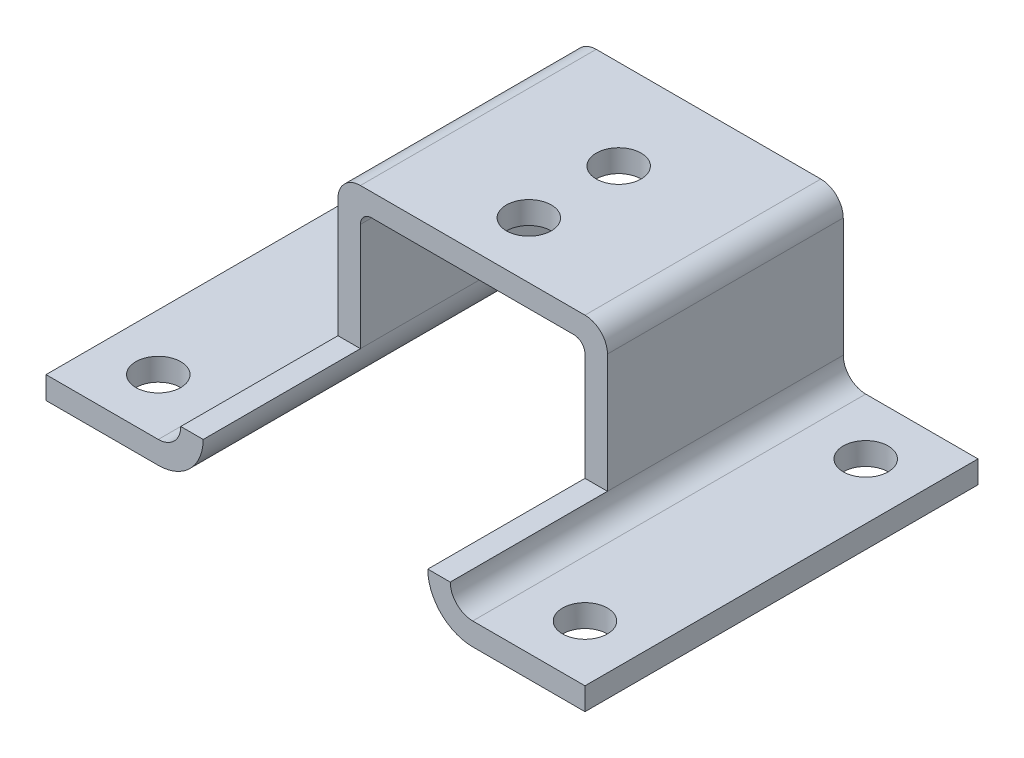
ISO-10303-21;
HEADER;
FILE_DESCRIPTION(('STEP AP214'),'2;1');
FILE_NAME('part.step','',(''),(''),'','','');
FILE_SCHEMA(('AUTOMOTIVE_DESIGN { 1 0 10303 214 1 1 1 1 }'));
ENDSEC;
DATA;
#1=APPLICATION_CONTEXT('core data for automotive mechanical design processes');
#2=APPLICATION_PROTOCOL_DEFINITION('international standard','automotive_design',2000,#1);
#3=PRODUCT_CONTEXT('',#1,'mechanical');
#4=PRODUCT('Part','Part','',(#3));
#5=PRODUCT_RELATED_PRODUCT_CATEGORY('part','',(#4));
#6=PRODUCT_DEFINITION_FORMATION('','',#4);
#7=PRODUCT_DEFINITION_CONTEXT('part definition',#1,'design');
#8=PRODUCT_DEFINITION('design','',#6,#7);
#9=PRODUCT_DEFINITION_SHAPE('','',#8);
#10=(LENGTH_UNIT() NAMED_UNIT(*) SI_UNIT(.MILLI.,.METRE.));
#11=(NAMED_UNIT(*) PLANE_ANGLE_UNIT() SI_UNIT($,.RADIAN.));
#12=(NAMED_UNIT(*) SI_UNIT($,.STERADIAN.) SOLID_ANGLE_UNIT());
#13=UNCERTAINTY_MEASURE_WITH_UNIT(LENGTH_MEASURE(1.E-05),#10,'distance_accuracy_value','');
#14=(GEOMETRIC_REPRESENTATION_CONTEXT(3) GLOBAL_UNCERTAINTY_ASSIGNED_CONTEXT((#13)) GLOBAL_UNIT_ASSIGNED_CONTEXT((#10,
#11,#12)) REPRESENTATION_CONTEXT('',''));
#15=CARTESIAN_POINT('',(0.,0.,0.));
#16=DIRECTION('',(0.,0.,1.));
#17=DIRECTION('',(1.,0.,0.));
#18=AXIS2_PLACEMENT_3D('',#15,#16,#17);
#19=CARTESIAN_POINT('',(0.,18.2678720989585,35.));
#20=DIRECTION('',(0.,-1.,0.));
#21=DIRECTION('',(0.,0.,-1.));
#22=AXIS2_PLACEMENT_3D('',#19,#20,#21);
#23=PLANE('',#22);
#24=CARTESIAN_POINT('',(19.,18.2678720989585,30.));
#25=DIRECTION('',(0.,-1.,0.));
#26=DIRECTION('',(0.,0.,-1.));
#27=AXIS2_PLACEMENT_3D('',#24,#25,#26);
#28=CIRCLE('',#27,2.);
#29=CARTESIAN_POINT('',(19.,18.2678720989585,28.));
#30=VERTEX_POINT('',#29);
#31=EDGE_CURVE('E354',#30,#30,#28,.T.);
#32=ORIENTED_EDGE('',*,*,#31,.T.);
#33=EDGE_LOOP('',(#32));
#34=FACE_BOUND('',#33,.T.);
#35=CARTESIAN_POINT('',(19.,18.2678720989585,5.));
#36=DIRECTION('',(0.,-1.,0.));
#37=DIRECTION('',(0.,0.,-1.));
#38=AXIS2_PLACEMENT_3D('',#35,#36,#37);
#39=CIRCLE('',#38,2.);
#40=CARTESIAN_POINT('',(19.,18.2678720989585,3.));
#41=VERTEX_POINT('',#40);
#42=EDGE_CURVE('E350',#41,#41,#39,.T.);
#43=ORIENTED_EDGE('',*,*,#42,.T.);
#44=EDGE_LOOP('',(#43));
#45=FACE_BOUND('',#44,.T.);
#46=DIRECTION('',(-1.,0.,0.));
#47=VECTOR('',#46,1.);
#48=CARTESIAN_POINT('',(0.,18.2678720989585,0.));
#49=LINE('',#48,#47);
#50=CARTESIAN_POINT('',(24.,18.2678720989585,0.));
#51=VERTEX_POINT('',#50);
#52=CARTESIAN_POINT('',(14.,18.2678720989585,0.));
#53=VERTEX_POINT('',#52);
#54=EDGE_CURVE('E302',#51,#53,#49,.T.);
#55=ORIENTED_EDGE('',*,*,#54,.T.);
#56=DIRECTION('',(0.,0.,-1.));
#57=VECTOR('',#56,1.);
#58=CARTESIAN_POINT('',(14.,18.2678720989585,35.));
#59=LINE('',#58,#57);
#60=CARTESIAN_POINT('',(14.,18.2678720989585,35.));
#61=VERTEX_POINT('',#60);
#62=EDGE_CURVE('E11',#61,#53,#59,.T.);
#63=ORIENTED_EDGE('',*,*,#62,.F.);
#64=DIRECTION('',(-1.,0.,0.));
#65=VECTOR('',#64,1.);
#66=CARTESIAN_POINT('',(0.,18.2678720989585,35.));
#67=LINE('',#66,#65);
#68=CARTESIAN_POINT('',(24.,18.2678720989585,35.));
#69=VERTEX_POINT('',#68);
#70=EDGE_CURVE('E303',#69,#61,#67,.T.);
#71=ORIENTED_EDGE('',*,*,#70,.F.);
#72=DIRECTION('',(0.,0.,-1.));
#73=VECTOR('',#72,1.);
#74=CARTESIAN_POINT('',(24.,18.2678720989585,35.));
#75=LINE('',#74,#73);
#76=EDGE_CURVE('E319',#69,#51,#75,.T.);
#77=ORIENTED_EDGE('',*,*,#76,.T.);
#78=EDGE_LOOP('',(#55,#63,#71,#77));
#79=FACE_BOUND('',#78,.T.);
#80=ADVANCED_FACE('F35',(#34,#45,#79),#23,.F.);
#81=CARTESIAN_POINT('',(14.,20.2678720989585,35.));
#82=DIRECTION('',(0.,0.,-1.));
#83=DIRECTION('',(-1.,0.,0.));
#84=AXIS2_PLACEMENT_3D('',#81,#82,#83);
#85=CYLINDRICAL_SURFACE('',#84,2.);
#86=CARTESIAN_POINT('',(14.,20.2678720989585,0.));
#87=DIRECTION('',(0.,0.,1.));
#88=DIRECTION('',(1.,0.,0.));
#89=AXIS2_PLACEMENT_3D('',#86,#87,#88);
#90=CIRCLE('',#89,2.);
#91=CARTESIAN_POINT('',(12.,20.2678720989585,0.));
#92=VERTEX_POINT('',#91);
#93=EDGE_CURVE('E322',#53,#92,#90,.F.);
#94=ORIENTED_EDGE('',*,*,#93,.T.);
#95=DIRECTION('',(0.,0.,-1.));
#96=VECTOR('',#95,1.);
#97=CARTESIAN_POINT('',(12.,20.2678720989585,21.));
#98=LINE('',#97,#96);
#99=CARTESIAN_POINT('',(12.,20.2678720989585,21.));
#100=VERTEX_POINT('',#99);
#101=EDGE_CURVE('E51',#100,#92,#98,.T.);
#102=ORIENTED_EDGE('',*,*,#101,.F.);
#103=DIRECTION('',(0.,0.,-1.));
#104=VECTOR('',#103,1.);
#105=CARTESIAN_POINT('',(12.,20.2678720989585,35.));
#106=LINE('',#105,#104);
#107=CARTESIAN_POINT('',(12.,20.2678720989585,35.));
#108=VERTEX_POINT('',#107);
#109=EDGE_CURVE('E43',#108,#100,#106,.T.);
#110=ORIENTED_EDGE('',*,*,#109,.F.);
#111=CARTESIAN_POINT('',(14.,20.2678720989585,35.));
#112=DIRECTION('',(0.,0.,1.));
#113=DIRECTION('',(1.,0.,0.));
#114=AXIS2_PLACEMENT_3D('',#111,#112,#113);
#115=CIRCLE('',#114,2.);
#116=EDGE_CURVE('E306',#61,#108,#115,.F.);
#117=ORIENTED_EDGE('',*,*,#116,.F.);
#118=ORIENTED_EDGE('',*,*,#62,.T.);
#119=EDGE_LOOP('',(#94,#102,#110,#117,#118));
#120=FACE_BOUND('',#119,.T.);
#121=ADVANCED_FACE('F451',(#120),#85,.F.);
#122=CARTESIAN_POINT('',(0.,20.2678720989584,35.));
#123=DIRECTION('',(0.,-1.,0.));
#124=DIRECTION('',(1.,0.,0.));
#125=AXIS2_PLACEMENT_3D('',#122,#123,#124);
#126=PLANE('',#125);
#127=ORIENTED_EDGE('',*,*,#109,.T.);
#128=DIRECTION('',(-1.,0.,0.));
#129=VECTOR('',#128,1.);
#130=CARTESIAN_POINT('',(0.,20.2678720989584,21.));
#131=LINE('',#130,#129);
#132=CARTESIAN_POINT('',(10.,20.2678720989585,21.));
#133=VERTEX_POINT('',#132);
#134=EDGE_CURVE('E58',#100,#133,#131,.T.);
#135=ORIENTED_EDGE('',*,*,#134,.T.);
#136=DIRECTION('',(0.,0.,-1.));
#137=VECTOR('',#136,1.);
#138=CARTESIAN_POINT('',(10.,20.2678720989585,35.));
#139=LINE('',#138,#137);
#140=CARTESIAN_POINT('',(10.,20.2678720989585,35.));
#141=VERTEX_POINT('',#140);
#142=EDGE_CURVE('E336',#141,#133,#139,.T.);
#143=ORIENTED_EDGE('',*,*,#142,.F.);
#144=DIRECTION('',(-1.,0.,0.));
#145=VECTOR('',#144,1.);
#146=CARTESIAN_POINT('',(0.,20.2678720989584,35.));
#147=LINE('',#146,#145);
#148=EDGE_CURVE('E309',#108,#141,#147,.T.);
#149=ORIENTED_EDGE('',*,*,#148,.F.);
#150=EDGE_LOOP('',(#127,#135,#143,#149));
#151=FACE_BOUND('',#150,.T.);
#152=ADVANCED_FACE('F444',(#151),#126,.F.);
#153=CARTESIAN_POINT('',(14.,20.2678720989585,35.));
#154=DIRECTION('',(0.,0.,-1.));
#155=DIRECTION('',(-1.,0.,0.));
#156=AXIS2_PLACEMENT_3D('',#153,#154,#155);
#157=CYLINDRICAL_SURFACE('',#156,4.);
#158=CARTESIAN_POINT('',(14.,20.2678720989585,0.));
#159=DIRECTION('',(0.,0.,1.));
#160=DIRECTION('',(1.,0.,0.));
#161=AXIS2_PLACEMENT_3D('',#158,#159,#160);
#162=CIRCLE('',#161,4.);
#163=CARTESIAN_POINT('',(14.,16.2678720989585,0.));
#164=VERTEX_POINT('',#163);
#165=CARTESIAN_POINT('',(10.,20.2678720989585,0.));
#166=VERTEX_POINT('',#165);
#167=EDGE_CURVE('E324',#164,#166,#162,.F.);
#168=ORIENTED_EDGE('',*,*,#167,.F.);
#169=DIRECTION('',(0.,0.,-1.));
#170=VECTOR('',#169,1.);
#171=CARTESIAN_POINT('',(14.,16.2678720989585,35.));
#172=LINE('',#171,#170);
#173=CARTESIAN_POINT('',(14.,16.2678720989585,35.));
#174=VERTEX_POINT('',#173);
#175=EDGE_CURVE('E334',#174,#164,#172,.T.);
#176=ORIENTED_EDGE('',*,*,#175,.F.);
#177=CARTESIAN_POINT('',(14.,20.2678720989585,35.));
#178=DIRECTION('',(0.,0.,1.));
#179=DIRECTION('',(1.,0.,0.));
#180=AXIS2_PLACEMENT_3D('',#177,#178,#179);
#181=CIRCLE('',#180,4.);
#182=EDGE_CURVE('E311',#174,#141,#181,.F.);
#183=ORIENTED_EDGE('',*,*,#182,.T.);
#184=ORIENTED_EDGE('',*,*,#142,.T.);
#185=DIRECTION('',(0.,0.,-1.));
#186=VECTOR('',#185,1.);
#187=CARTESIAN_POINT('',(10.,20.2678720989585,21.));
#188=LINE('',#187,#186);
#189=EDGE_CURVE('E280',#133,#166,#188,.T.);
#190=ORIENTED_EDGE('',*,*,#189,.T.);
#191=EDGE_LOOP('',(#168,#176,#183,#184,#190));
#192=FACE_BOUND('',#191,.T.);
#193=ADVANCED_FACE('F441',(#192),#157,.T.);
#194=CARTESIAN_POINT('',(0.,16.2678720989585,35.));
#195=DIRECTION('',(0.,-1.,0.));
#196=DIRECTION('',(1.,0.,0.));
#197=AXIS2_PLACEMENT_3D('',#194,#195,#196);
#198=PLANE('',#197);
#199=CARTESIAN_POINT('',(19.,16.2678720989585,30.));
#200=DIRECTION('',(0.,1.,0.));
#201=DIRECTION('',(0.,0.,1.));
#202=AXIS2_PLACEMENT_3D('',#199,#200,#201);
#203=CIRCLE('',#202,2.);
#204=CARTESIAN_POINT('',(19.,16.2678720989585,32.));
#205=VERTEX_POINT('',#204);
#206=EDGE_CURVE('E549',#205,#205,#203,.T.);
#207=ORIENTED_EDGE('',*,*,#206,.T.);
#208=EDGE_LOOP('',(#207));
#209=FACE_BOUND('',#208,.T.);
#210=CARTESIAN_POINT('',(19.,16.2678720989585,5.));
#211=DIRECTION('',(0.,1.,0.));
#212=DIRECTION('',(0.,0.,1.));
#213=AXIS2_PLACEMENT_3D('',#210,#211,#212);
#214=CIRCLE('',#213,2.);
#215=CARTESIAN_POINT('',(19.,16.2678720989585,7.));
#216=VERTEX_POINT('',#215);
#217=EDGE_CURVE('E547',#216,#216,#214,.T.);
#218=ORIENTED_EDGE('',*,*,#217,.T.);
#219=EDGE_LOOP('',(#218));
#220=FACE_BOUND('',#219,.T.);
#221=DIRECTION('',(-1.,0.,0.));
#222=VECTOR('',#221,1.);
#223=CARTESIAN_POINT('',(0.,16.2678720989585,0.));
#224=LINE('',#223,#222);
#225=CARTESIAN_POINT('',(24.,16.2678720989585,0.));
#226=VERTEX_POINT('',#225);
#227=EDGE_CURVE('E326',#226,#164,#224,.T.);
#228=ORIENTED_EDGE('',*,*,#227,.F.);
#229=DIRECTION('',(0.,0.,-1.));
#230=VECTOR('',#229,1.);
#231=CARTESIAN_POINT('',(24.,16.2678720989585,35.));
#232=LINE('',#231,#230);
#233=CARTESIAN_POINT('',(24.,16.2678720989585,35.));
#234=VERTEX_POINT('',#233);
#235=EDGE_CURVE('E332',#234,#226,#232,.T.);
#236=ORIENTED_EDGE('',*,*,#235,.F.);
#237=DIRECTION('',(-1.,0.,0.));
#238=VECTOR('',#237,1.);
#239=CARTESIAN_POINT('',(0.,16.2678720989585,35.));
#240=LINE('',#239,#238);
#241=EDGE_CURVE('E314',#234,#174,#240,.T.);
#242=ORIENTED_EDGE('',*,*,#241,.T.);
#243=ORIENTED_EDGE('',*,*,#175,.T.);
#244=EDGE_LOOP('',(#228,#236,#242,#243));
#245=FACE_BOUND('',#244,.T.);
#246=ADVANCED_FACE('F462',(#209,#220,#245),#198,.T.);
#247=CARTESIAN_POINT('',(24.,0.,35.));
#248=DIRECTION('',(-1.,0.,0.));
#249=DIRECTION('',(0.,0.,1.));
#250=AXIS2_PLACEMENT_3D('',#247,#248,#249);
#251=PLANE('',#250);
#252=DIRECTION('',(0.,1.,0.));
#253=VECTOR('',#252,1.);
#254=CARTESIAN_POINT('',(24.,0.,0.));
#255=LINE('',#254,#253);
#256=EDGE_CURVE('E307',#226,#51,#255,.T.);
#257=ORIENTED_EDGE('',*,*,#256,.T.);
#258=ORIENTED_EDGE('',*,*,#76,.F.);
#259=DIRECTION('',(0.,1.,0.));
#260=VECTOR('',#259,1.);
#261=CARTESIAN_POINT('',(24.,0.,35.));
#262=LINE('',#261,#260);
#263=EDGE_CURVE('E317',#234,#69,#262,.T.);
#264=ORIENTED_EDGE('',*,*,#263,.F.);
#265=ORIENTED_EDGE('',*,*,#235,.T.);
#266=EDGE_LOOP('',(#257,#258,#264,#265));
#267=FACE_BOUND('',#266,.T.);
#268=ADVANCED_FACE('F465',(#267),#251,.F.);
#269=CARTESIAN_POINT('',(0.,0.,35.));
#270=DIRECTION('',(0.,0.,1.));
#271=DIRECTION('',(1.,0.,0.));
#272=AXIS2_PLACEMENT_3D('',#269,#270,#271);
#273=PLANE('',#272);
#274=ORIENTED_EDGE('',*,*,#70,.T.);
#275=ORIENTED_EDGE('',*,*,#116,.T.);
#276=ORIENTED_EDGE('',*,*,#148,.T.);
#277=ORIENTED_EDGE('',*,*,#182,.F.);
#278=ORIENTED_EDGE('',*,*,#241,.F.);
#279=ORIENTED_EDGE('',*,*,#263,.T.);
#280=EDGE_LOOP('',(#274,#275,#276,#277,#278,#279));
#281=FACE_BOUND('',#280,.T.);
#282=ADVANCED_FACE('F447',(#281),#273,.T.);
#283=CARTESIAN_POINT('',(0.,0.,0.));
#284=DIRECTION('',(0.,0.,1.));
#285=DIRECTION('',(1.,0.,0.));
#286=AXIS2_PLACEMENT_3D('',#283,#284,#285);
#287=PLANE('',#286);
#288=ORIENTED_EDGE('',*,*,#54,.F.);
#289=ORIENTED_EDGE('',*,*,#256,.F.);
#290=ORIENTED_EDGE('',*,*,#227,.T.);
#291=ORIENTED_EDGE('',*,*,#167,.T.);
#292=DIRECTION('',(0.,1.,0.));
#293=VECTOR('',#292,1.);
#294=CARTESIAN_POINT('',(10.,0.,0.));
#295=LINE('',#294,#293);
#296=CARTESIAN_POINT('',(10.,29.8536585365853,0.));
#297=VERTEX_POINT('',#296);
#298=EDGE_CURVE('E268',#166,#297,#295,.T.);
#299=ORIENTED_EDGE('',*,*,#298,.T.);
#300=CARTESIAN_POINT('',(9.,29.8536585365853,0.));
#301=DIRECTION('',(0.,0.,1.));
#302=DIRECTION('',(1.,0.,0.));
#303=AXIS2_PLACEMENT_3D('',#300,#301,#302);
#304=CIRCLE('',#303,1.);
#305=CARTESIAN_POINT('',(8.99999999999999,30.8536585365853,0.));
#306=VERTEX_POINT('',#305);
#307=EDGE_CURVE('E265',#297,#306,#304,.T.);
#308=ORIENTED_EDGE('',*,*,#307,.T.);
#309=DIRECTION('',(1.,0.,0.));
#310=VECTOR('',#309,1.);
#311=CARTESIAN_POINT('',(0.,30.8536585365853,0.));
#312=LINE('',#311,#310);
#313=CARTESIAN_POINT('',(-8.99999999999999,30.8536585365853,0.));
#314=VERTEX_POINT('',#313);
#315=EDGE_CURVE('E262',#314,#306,#312,.T.);
#316=ORIENTED_EDGE('',*,*,#315,.F.);
#317=CARTESIAN_POINT('',(-9.,29.8536585365853,0.));
#318=DIRECTION('',(0.,0.,1.));
#319=DIRECTION('',(1.,0.,0.));
#320=AXIS2_PLACEMENT_3D('',#317,#318,#319);
#321=CIRCLE('',#320,1.);
#322=CARTESIAN_POINT('',(-10.,29.8536585365853,0.));
#323=VERTEX_POINT('',#322);
#324=EDGE_CURVE('E260',#323,#314,#321,.F.);
#325=ORIENTED_EDGE('',*,*,#324,.F.);
#326=DIRECTION('',(0.,1.,0.));
#327=VECTOR('',#326,1.);
#328=CARTESIAN_POINT('',(-10.,0.,0.));
#329=LINE('',#328,#327);
#330=CARTESIAN_POINT('',(-10.,20.2678720989585,0.));
#331=VERTEX_POINT('',#330);
#332=EDGE_CURVE('E258',#331,#323,#329,.T.);
#333=ORIENTED_EDGE('',*,*,#332,.F.);
#334=CARTESIAN_POINT('',(-14.,20.2678720989585,0.));
#335=DIRECTION('',(0.,0.,1.));
#336=DIRECTION('',(1.,0.,0.));
#337=AXIS2_PLACEMENT_3D('',#334,#335,#336);
#338=CIRCLE('',#337,4.);
#339=CARTESIAN_POINT('',(-14.,16.2678720989585,0.));
#340=VERTEX_POINT('',#339);
#341=EDGE_CURVE('E373',#340,#331,#338,.T.);
#342=ORIENTED_EDGE('',*,*,#341,.F.);
#343=DIRECTION('',(1.,0.,0.));
#344=VECTOR('',#343,1.);
#345=CARTESIAN_POINT('',(0.,16.2678720989585,0.));
#346=LINE('',#345,#344);
#347=CARTESIAN_POINT('',(-24.,16.2678720989585,0.));
#348=VERTEX_POINT('',#347);
#349=EDGE_CURVE('E212',#348,#340,#346,.T.);
#350=ORIENTED_EDGE('',*,*,#349,.F.);
#351=DIRECTION('',(0.,1.,0.));
#352=VECTOR('',#351,1.);
#353=CARTESIAN_POINT('',(-24.,0.,0.));
#354=LINE('',#353,#352);
#355=CARTESIAN_POINT('',(-24.,18.2678720989585,0.));
#356=VERTEX_POINT('',#355);
#357=EDGE_CURVE('E208',#348,#356,#354,.T.);
#358=ORIENTED_EDGE('',*,*,#357,.T.);
#359=DIRECTION('',(1.,0.,0.));
#360=VECTOR('',#359,1.);
#361=CARTESIAN_POINT('',(0.,18.2678720989585,0.));
#362=LINE('',#361,#360);
#363=CARTESIAN_POINT('',(-14.,18.2678720989585,0.));
#364=VERTEX_POINT('',#363);
#365=EDGE_CURVE('E378',#356,#364,#362,.T.);
#366=ORIENTED_EDGE('',*,*,#365,.T.);
#367=CARTESIAN_POINT('',(-14.,20.2678720989585,0.));
#368=DIRECTION('',(0.,0.,1.));
#369=DIRECTION('',(1.,0.,0.));
#370=AXIS2_PLACEMENT_3D('',#367,#368,#369);
#371=CIRCLE('',#370,2.);
#372=CARTESIAN_POINT('',(-12.,20.2678720989585,0.));
#373=VERTEX_POINT('',#372);
#374=EDGE_CURVE('E375',#364,#373,#371,.T.);
#375=ORIENTED_EDGE('',*,*,#374,.T.);
#376=DIRECTION('',(0.,1.,0.));
#377=VECTOR('',#376,1.);
#378=CARTESIAN_POINT('',(-12.,0.,0.));
#379=LINE('',#378,#377);
#380=CARTESIAN_POINT('',(-12.,30.8536585365853,0.));
#381=VERTEX_POINT('',#380);
#382=EDGE_CURVE('E255',#373,#381,#379,.T.);
#383=ORIENTED_EDGE('',*,*,#382,.T.);
#384=CARTESIAN_POINT('',(-10.,30.8536585365853,0.));
#385=DIRECTION('',(0.,0.,1.));
#386=DIRECTION('',(1.,0.,0.));
#387=AXIS2_PLACEMENT_3D('',#384,#385,#386);
#388=CIRCLE('',#387,2.00000000000001);
#389=CARTESIAN_POINT('',(-9.99999999999998,32.8536585365854,0.));
#390=VERTEX_POINT('',#389);
#391=EDGE_CURVE('E216',#381,#390,#388,.F.);
#392=ORIENTED_EDGE('',*,*,#391,.T.);
#393=DIRECTION('',(1.,0.,0.));
#394=VECTOR('',#393,1.);
#395=CARTESIAN_POINT('',(0.,32.8536585365854,0.));
#396=LINE('',#395,#394);
#397=CARTESIAN_POINT('',(9.99999999999998,32.8536585365854,0.));
#398=VERTEX_POINT('',#397);
#399=EDGE_CURVE('E213',#390,#398,#396,.T.);
#400=ORIENTED_EDGE('',*,*,#399,.T.);
#401=CARTESIAN_POINT('',(10.,30.8536585365853,0.));
#402=DIRECTION('',(0.,0.,1.));
#403=DIRECTION('',(1.,0.,0.));
#404=AXIS2_PLACEMENT_3D('',#401,#402,#403);
#405=CIRCLE('',#404,2.00000000000001);
#406=CARTESIAN_POINT('',(12.,30.8536585365853,0.));
#407=VERTEX_POINT('',#406);
#408=EDGE_CURVE('E226',#407,#398,#405,.T.);
#409=ORIENTED_EDGE('',*,*,#408,.F.);
#410=DIRECTION('',(0.,1.,0.));
#411=VECTOR('',#410,1.);
#412=CARTESIAN_POINT('',(12.,0.,0.));
#413=LINE('',#412,#411);
#414=EDGE_CURVE('E271',#92,#407,#413,.T.);
#415=ORIENTED_EDGE('',*,*,#414,.F.);
#416=ORIENTED_EDGE('',*,*,#93,.F.);
#417=EDGE_LOOP('',(#288,#289,#290,#291,#299,#308,#316,#325,#333,#342,#350,#358,#366,#375,#383,
#392,#400,#409,#415,#416));
#418=FACE_BOUND('',#417,.T.);
#419=ADVANCED_FACE('F409',(#418),#287,.F.);
#420=CARTESIAN_POINT('',(0.,32.8536585365854,21.));
#421=DIRECTION('',(0.,1.,0.));
#422=DIRECTION('',(0.,0.,1.));
#423=AXIS2_PLACEMENT_3D('',#420,#421,#422);
#424=PLANE('',#423);
#425=CARTESIAN_POINT('',(0.,32.8536585365854,16.));
#426=DIRECTION('',(0.,1.,0.));
#427=DIRECTION('',(0.,0.,1.));
#428=AXIS2_PLACEMENT_3D('',#425,#426,#427);
#429=CIRCLE('',#428,2.);
#430=CARTESIAN_POINT('',(0.,32.8536585365854,18.));
#431=VERTEX_POINT('',#430);
#432=EDGE_CURVE('E554',#431,#431,#429,.T.);
#433=ORIENTED_EDGE('',*,*,#432,.F.);
#434=EDGE_LOOP('',(#433));
#435=FACE_BOUND('',#434,.T.);
#436=CARTESIAN_POINT('',(0.,32.8536585365854,8.));
#437=DIRECTION('',(0.,1.,0.));
#438=DIRECTION('',(0.,0.,1.));
#439=AXIS2_PLACEMENT_3D('',#436,#437,#438);
#440=CIRCLE('',#439,2.);
#441=CARTESIAN_POINT('',(0.,32.8536585365854,10.));
#442=VERTEX_POINT('',#441);
#443=EDGE_CURVE('E343',#442,#442,#440,.T.);
#444=ORIENTED_EDGE('',*,*,#443,.F.);
#445=EDGE_LOOP('',(#444));
#446=FACE_BOUND('',#445,.T.);
#447=ORIENTED_EDGE('',*,*,#399,.F.);
#448=DIRECTION('',(0.,0.,-1.));
#449=VECTOR('',#448,1.);
#450=CARTESIAN_POINT('',(-9.99999999999998,32.8536585365854,21.));
#451=LINE('',#450,#449);
#452=CARTESIAN_POINT('',(-9.99999999999998,32.8536585365854,21.));
#453=VERTEX_POINT('',#452);
#454=EDGE_CURVE('E300',#453,#390,#451,.T.);
#455=ORIENTED_EDGE('',*,*,#454,.F.);
#456=DIRECTION('',(1.,0.,0.));
#457=VECTOR('',#456,1.);
#458=CARTESIAN_POINT('',(0.,32.8536585365854,21.));
#459=LINE('',#458,#457);
#460=CARTESIAN_POINT('',(9.99999999999998,32.8536585365854,21.));
#461=VERTEX_POINT('',#460);
#462=EDGE_CURVE('E222',#453,#461,#459,.T.);
#463=ORIENTED_EDGE('',*,*,#462,.T.);
#464=DIRECTION('',(0.,0.,-1.));
#465=VECTOR('',#464,1.);
#466=CARTESIAN_POINT('',(9.99999999999998,32.8536585365854,21.));
#467=LINE('',#466,#465);
#468=EDGE_CURVE('E251',#461,#398,#467,.T.);
#469=ORIENTED_EDGE('',*,*,#468,.T.);
#470=EDGE_LOOP('',(#447,#455,#463,#469));
#471=FACE_BOUND('',#470,.T.);
#472=ADVANCED_FACE('F472',(#435,#446,#471),#424,.T.);
#473=CARTESIAN_POINT('',(-10.,30.8536585365853,21.));
#474=DIRECTION('',(0.,0.,-1.));
#475=DIRECTION('',(-1.,0.,0.));
#476=AXIS2_PLACEMENT_3D('',#473,#474,#475);
#477=CYLINDRICAL_SURFACE('',#476,2.00000000000001);
#478=ORIENTED_EDGE('',*,*,#391,.F.);
#479=DIRECTION('',(0.,0.,-1.));
#480=VECTOR('',#479,1.);
#481=CARTESIAN_POINT('',(-12.,30.8536585365853,21.));
#482=LINE('',#481,#480);
#483=CARTESIAN_POINT('',(-12.,30.8536585365853,21.));
#484=VERTEX_POINT('',#483);
#485=EDGE_CURVE('E298',#484,#381,#482,.T.);
#486=ORIENTED_EDGE('',*,*,#485,.F.);
#487=CARTESIAN_POINT('',(-10.,30.8536585365853,21.));
#488=DIRECTION('',(0.,0.,1.));
#489=DIRECTION('',(1.,0.,0.));
#490=AXIS2_PLACEMENT_3D('',#487,#488,#489);
#491=CIRCLE('',#490,2.00000000000001);
#492=EDGE_CURVE('E225',#484,#453,#491,.F.);
#493=ORIENTED_EDGE('',*,*,#492,.T.);
#494=ORIENTED_EDGE('',*,*,#454,.T.);
#495=EDGE_LOOP('',(#478,#486,#493,#494));
#496=FACE_BOUND('',#495,.T.);
#497=ADVANCED_FACE('F405',(#496),#477,.T.);
#498=CARTESIAN_POINT('',(-12.,0.,21.));
#499=DIRECTION('',(-1.,0.,0.));
#500=DIRECTION('',(0.,-1.,0.));
#501=AXIS2_PLACEMENT_3D('',#498,#499,#500);
#502=PLANE('',#501);
#503=ORIENTED_EDGE('',*,*,#382,.F.);
#504=DIRECTION('',(0.,0.,-1.));
#505=VECTOR('',#504,1.);
#506=CARTESIAN_POINT('',(-12.,20.2678720989585,21.));
#507=LINE('',#506,#505);
#508=CARTESIAN_POINT('',(-12.,20.2678720989585,21.));
#509=VERTEX_POINT('',#508);
#510=EDGE_CURVE('E296',#509,#373,#507,.T.);
#511=ORIENTED_EDGE('',*,*,#510,.F.);
#512=DIRECTION('',(0.,1.,0.));
#513=VECTOR('',#512,1.);
#514=CARTESIAN_POINT('',(-12.,0.,21.));
#515=LINE('',#514,#513);
#516=EDGE_CURVE('E229',#509,#484,#515,.T.);
#517=ORIENTED_EDGE('',*,*,#516,.T.);
#518=ORIENTED_EDGE('',*,*,#485,.T.);
#519=EDGE_LOOP('',(#503,#511,#517,#518));
#520=FACE_BOUND('',#519,.T.);
#521=ADVANCED_FACE('F397',(#520),#502,.T.);
#522=CARTESIAN_POINT('',(-10.,0.,21.));
#523=DIRECTION('',(-1.,0.,0.));
#524=DIRECTION('',(0.,0.,1.));
#525=AXIS2_PLACEMENT_3D('',#522,#523,#524);
#526=PLANE('',#525);
#527=ORIENTED_EDGE('',*,*,#332,.T.);
#528=DIRECTION('',(0.,0.,-1.));
#529=VECTOR('',#528,1.);
#530=CARTESIAN_POINT('',(-10.,29.8536585365853,21.));
#531=LINE('',#530,#529);
#532=CARTESIAN_POINT('',(-10.,29.8536585365853,21.));
#533=VERTEX_POINT('',#532);
#534=EDGE_CURVE('E290',#533,#323,#531,.T.);
#535=ORIENTED_EDGE('',*,*,#534,.F.);
#536=DIRECTION('',(0.,1.,0.));
#537=VECTOR('',#536,1.);
#538=CARTESIAN_POINT('',(-10.,0.,21.));
#539=LINE('',#538,#537);
#540=CARTESIAN_POINT('',(-10.,20.2678720989585,21.));
#541=VERTEX_POINT('',#540);
#542=EDGE_CURVE('E235',#541,#533,#539,.T.);
#543=ORIENTED_EDGE('',*,*,#542,.F.);
#544=DIRECTION('',(0.,0.,-1.));
#545=VECTOR('',#544,1.);
#546=CARTESIAN_POINT('',(-10.,20.2678720989585,21.));
#547=LINE('',#546,#545);
#548=EDGE_CURVE('E293',#541,#331,#547,.T.);
#549=ORIENTED_EDGE('',*,*,#548,.T.);
#550=EDGE_LOOP('',(#527,#535,#543,#549));
#551=FACE_BOUND('',#550,.T.);
#552=ADVANCED_FACE('F419',(#551),#526,.F.);
#553=CARTESIAN_POINT('',(-9.,29.8536585365853,21.));
#554=DIRECTION('',(0.,0.,-1.));
#555=DIRECTION('',(-1.,0.,0.));
#556=AXIS2_PLACEMENT_3D('',#553,#554,#555);
#557=CYLINDRICAL_SURFACE('',#556,1.);
#558=ORIENTED_EDGE('',*,*,#324,.T.);
#559=DIRECTION('',(0.,0.,-1.));
#560=VECTOR('',#559,1.);
#561=CARTESIAN_POINT('',(-8.99999999999999,30.8536585365853,21.));
#562=LINE('',#561,#560);
#563=CARTESIAN_POINT('',(-8.99999999999999,30.8536585365853,21.));
#564=VERTEX_POINT('',#563);
#565=EDGE_CURVE('E287',#564,#314,#562,.T.);
#566=ORIENTED_EDGE('',*,*,#565,.F.);
#567=CARTESIAN_POINT('',(-9.,29.8536585365853,21.));
#568=DIRECTION('',(0.,0.,1.));
#569=DIRECTION('',(1.,0.,0.));
#570=AXIS2_PLACEMENT_3D('',#567,#568,#569);
#571=CIRCLE('',#570,1.);
#572=EDGE_CURVE('E237',#533,#564,#571,.F.);
#573=ORIENTED_EDGE('',*,*,#572,.F.);
#574=ORIENTED_EDGE('',*,*,#534,.T.);
#575=EDGE_LOOP('',(#558,#566,#573,#574));
#576=FACE_BOUND('',#575,.T.);
#577=ADVANCED_FACE('F427',(#576),#557,.F.);
#578=CARTESIAN_POINT('',(0.,30.8536585365853,21.));
#579=DIRECTION('',(0.,1.,0.));
#580=DIRECTION('',(0.,0.,1.));
#581=AXIS2_PLACEMENT_3D('',#578,#579,#580);
#582=PLANE('',#581);
#583=CARTESIAN_POINT('',(0.,30.8536585365853,16.));
#584=DIRECTION('',(0.,1.,0.));
#585=DIRECTION('',(0.,0.,1.));
#586=AXIS2_PLACEMENT_3D('',#583,#584,#585);
#587=CIRCLE('',#586,2.);
#588=CARTESIAN_POINT('',(0.,30.8536585365853,18.));
#589=VERTEX_POINT('',#588);
#590=EDGE_CURVE('E38',#589,#589,#587,.T.);
#591=ORIENTED_EDGE('',*,*,#590,.T.);
#592=EDGE_LOOP('',(#591));
#593=FACE_BOUND('',#592,.T.);
#594=CARTESIAN_POINT('',(0.,30.8536585365853,8.));
#595=DIRECTION('',(0.,1.,0.));
#596=DIRECTION('',(0.,0.,1.));
#597=AXIS2_PLACEMENT_3D('',#594,#595,#596);
#598=CIRCLE('',#597,2.);
#599=CARTESIAN_POINT('',(0.,30.8536585365853,10.));
#600=VERTEX_POINT('',#599);
#601=EDGE_CURVE('E345',#600,#600,#598,.T.);
#602=ORIENTED_EDGE('',*,*,#601,.T.);
#603=EDGE_LOOP('',(#602));
#604=FACE_BOUND('',#603,.T.);
#605=ORIENTED_EDGE('',*,*,#315,.T.);
#606=DIRECTION('',(0.,0.,-1.));
#607=VECTOR('',#606,1.);
#608=CARTESIAN_POINT('',(8.99999999999999,30.8536585365853,21.));
#609=LINE('',#608,#607);
#610=CARTESIAN_POINT('',(8.99999999999999,30.8536585365853,21.));
#611=VERTEX_POINT('',#610);
#612=EDGE_CURVE('E285',#611,#306,#609,.T.);
#613=ORIENTED_EDGE('',*,*,#612,.F.);
#614=DIRECTION('',(1.,0.,0.));
#615=VECTOR('',#614,1.);
#616=CARTESIAN_POINT('',(0.,30.8536585365853,21.));
#617=LINE('',#616,#615);
#618=EDGE_CURVE('E239',#564,#611,#617,.T.);
#619=ORIENTED_EDGE('',*,*,#618,.F.);
#620=ORIENTED_EDGE('',*,*,#565,.T.);
#621=EDGE_LOOP('',(#605,#613,#619,#620));
#622=FACE_BOUND('',#621,.T.);
#623=ADVANCED_FACE('F430',(#593,#604,#622),#582,.F.);
#624=CARTESIAN_POINT('',(9.,29.8536585365853,21.));
#625=DIRECTION('',(0.,0.,-1.));
#626=DIRECTION('',(-1.,0.,0.));
#627=AXIS2_PLACEMENT_3D('',#624,#625,#626);
#628=CYLINDRICAL_SURFACE('',#627,1.);
#629=ORIENTED_EDGE('',*,*,#307,.F.);
#630=DIRECTION('',(0.,0.,-1.));
#631=VECTOR('',#630,1.);
#632=CARTESIAN_POINT('',(10.,29.8536585365853,21.));
#633=LINE('',#632,#631);
#634=CARTESIAN_POINT('',(10.,29.8536585365853,21.));
#635=VERTEX_POINT('',#634);
#636=EDGE_CURVE('E283',#635,#297,#633,.T.);
#637=ORIENTED_EDGE('',*,*,#636,.F.);
#638=CARTESIAN_POINT('',(9.,29.8536585365853,21.));
#639=DIRECTION('',(0.,0.,1.));
#640=DIRECTION('',(1.,0.,0.));
#641=AXIS2_PLACEMENT_3D('',#638,#639,#640);
#642=CIRCLE('',#641,1.);
#643=EDGE_CURVE('E241',#635,#611,#642,.T.);
#644=ORIENTED_EDGE('',*,*,#643,.T.);
#645=ORIENTED_EDGE('',*,*,#612,.T.);
#646=EDGE_LOOP('',(#629,#637,#644,#645));
#647=FACE_BOUND('',#646,.T.);
#648=ADVANCED_FACE('F433',(#647),#628,.F.);
#649=CARTESIAN_POINT('',(10.,0.,21.));
#650=DIRECTION('',(-1.,0.,0.));
#651=DIRECTION('',(0.,0.,1.));
#652=AXIS2_PLACEMENT_3D('',#649,#650,#651);
#653=PLANE('',#652);
#654=ORIENTED_EDGE('',*,*,#298,.F.);
#655=ORIENTED_EDGE('',*,*,#189,.F.);
#656=DIRECTION('',(0.,1.,0.));
#657=VECTOR('',#656,1.);
#658=CARTESIAN_POINT('',(10.,0.,21.));
#659=LINE('',#658,#657);
#660=EDGE_CURVE('E244',#133,#635,#659,.T.);
#661=ORIENTED_EDGE('',*,*,#660,.T.);
#662=ORIENTED_EDGE('',*,*,#636,.T.);
#663=EDGE_LOOP('',(#654,#655,#661,#662));
#664=FACE_BOUND('',#663,.T.);
#665=ADVANCED_FACE('F438',(#664),#653,.T.);
#666=CARTESIAN_POINT('',(12.,0.,21.));
#667=DIRECTION('',(-1.,0.,0.));
#668=DIRECTION('',(0.,-1.,0.));
#669=AXIS2_PLACEMENT_3D('',#666,#667,#668);
#670=PLANE('',#669);
#671=ORIENTED_EDGE('',*,*,#414,.T.);
#672=DIRECTION('',(0.,0.,-1.));
#673=VECTOR('',#672,1.);
#674=CARTESIAN_POINT('',(12.,30.8536585365853,21.));
#675=LINE('',#674,#673);
#676=CARTESIAN_POINT('',(12.,30.8536585365853,21.));
#677=VERTEX_POINT('',#676);
#678=EDGE_CURVE('E276',#677,#407,#675,.T.);
#679=ORIENTED_EDGE('',*,*,#678,.F.);
#680=DIRECTION('',(0.,1.,0.));
#681=VECTOR('',#680,1.);
#682=CARTESIAN_POINT('',(12.,0.,21.));
#683=LINE('',#682,#681);
#684=EDGE_CURVE('E248',#100,#677,#683,.T.);
#685=ORIENTED_EDGE('',*,*,#684,.F.);
#686=ORIENTED_EDGE('',*,*,#101,.T.);
#687=EDGE_LOOP('',(#671,#679,#685,#686));
#688=FACE_BOUND('',#687,.T.);
#689=ADVANCED_FACE('F492',(#688),#670,.F.);
#690=CARTESIAN_POINT('',(10.,30.8536585365853,21.));
#691=DIRECTION('',(0.,0.,-1.));
#692=DIRECTION('',(-1.,0.,0.));
#693=AXIS2_PLACEMENT_3D('',#690,#691,#692);
#694=CYLINDRICAL_SURFACE('',#693,2.00000000000001);
#695=ORIENTED_EDGE('',*,*,#408,.T.);
#696=ORIENTED_EDGE('',*,*,#468,.F.);
#697=CARTESIAN_POINT('',(10.,30.8536585365853,21.));
#698=DIRECTION('',(0.,0.,1.));
#699=DIRECTION('',(1.,0.,0.));
#700=AXIS2_PLACEMENT_3D('',#697,#698,#699);
#701=CIRCLE('',#700,2.00000000000001);
#702=EDGE_CURVE('E250',#677,#461,#701,.T.);
#703=ORIENTED_EDGE('',*,*,#702,.F.);
#704=ORIENTED_EDGE('',*,*,#678,.T.);
#705=EDGE_LOOP('',(#695,#696,#703,#704));
#706=FACE_BOUND('',#705,.T.);
#707=ADVANCED_FACE('F495',(#706),#694,.T.);
#708=CARTESIAN_POINT('',(0.,0.,21.));
#709=DIRECTION('',(0.,0.,1.));
#710=DIRECTION('',(1.,0.,0.));
#711=AXIS2_PLACEMENT_3D('',#708,#709,#710);
#712=PLANE('',#711);
#713=ORIENTED_EDGE('',*,*,#462,.F.);
#714=ORIENTED_EDGE('',*,*,#492,.F.);
#715=ORIENTED_EDGE('',*,*,#516,.F.);
#716=DIRECTION('',(1.,0.,0.));
#717=VECTOR('',#716,1.);
#718=CARTESIAN_POINT('',(0.,20.2678720989584,21.));
#719=LINE('',#718,#717);
#720=EDGE_CURVE('E232',#509,#541,#719,.T.);
#721=ORIENTED_EDGE('',*,*,#720,.T.);
#722=ORIENTED_EDGE('',*,*,#542,.T.);
#723=ORIENTED_EDGE('',*,*,#572,.T.);
#724=ORIENTED_EDGE('',*,*,#618,.T.);
#725=ORIENTED_EDGE('',*,*,#643,.F.);
#726=ORIENTED_EDGE('',*,*,#660,.F.);
#727=ORIENTED_EDGE('',*,*,#134,.F.);
#728=ORIENTED_EDGE('',*,*,#684,.T.);
#729=ORIENTED_EDGE('',*,*,#702,.T.);
#730=EDGE_LOOP('',(#713,#714,#715,#721,#722,#723,#724,#725,#726,#727,#728,#729));
#731=FACE_BOUND('',#730,.T.);
#732=ADVANCED_FACE('F401',(#731),#712,.T.);
#733=CARTESIAN_POINT('',(0.,16.2678720989585,35.));
#734=DIRECTION('',(0.,1.,0.));
#735=DIRECTION('',(-1.,0.,0.));
#736=AXIS2_PLACEMENT_3D('',#733,#734,#735);
#737=PLANE('',#736);
#738=CARTESIAN_POINT('',(-19.,16.2678720989585,5.));
#739=DIRECTION('',(0.,1.,0.));
#740=DIRECTION('',(0.,0.,1.));
#741=AXIS2_PLACEMENT_3D('',#738,#739,#740);
#742=CIRCLE('',#741,2.);
#743=CARTESIAN_POINT('',(-19.,16.2678720989585,7.));
#744=VERTEX_POINT('',#743);
#745=EDGE_CURVE('E557',#744,#744,#742,.T.);
#746=ORIENTED_EDGE('',*,*,#745,.T.);
#747=EDGE_LOOP('',(#746));
#748=FACE_BOUND('',#747,.T.);
#749=CARTESIAN_POINT('',(-19.,16.2678720989585,30.));
#750=DIRECTION('',(0.,1.,0.));
#751=DIRECTION('',(0.,0.,1.));
#752=AXIS2_PLACEMENT_3D('',#749,#750,#751);
#753=CIRCLE('',#752,2.00000000000001);
#754=CARTESIAN_POINT('',(-19.,16.2678720989585,32.));
#755=VERTEX_POINT('',#754);
#756=EDGE_CURVE('E552',#755,#755,#753,.T.);
#757=ORIENTED_EDGE('',*,*,#756,.T.);
#758=EDGE_LOOP('',(#757));
#759=FACE_BOUND('',#758,.T.);
#760=ORIENTED_EDGE('',*,*,#349,.T.);
#761=DIRECTION('',(0.,0.,-1.));
#762=VECTOR('',#761,1.);
#763=CARTESIAN_POINT('',(-14.,16.2678720989585,35.));
#764=LINE('',#763,#762);
#765=CARTESIAN_POINT('',(-14.,16.2678720989585,35.));
#766=VERTEX_POINT('',#765);
#767=EDGE_CURVE('E191',#766,#340,#764,.T.);
#768=ORIENTED_EDGE('',*,*,#767,.F.);
#769=DIRECTION('',(1.,0.,0.));
#770=VECTOR('',#769,1.);
#771=CARTESIAN_POINT('',(0.,16.2678720989585,35.));
#772=LINE('',#771,#770);
#773=CARTESIAN_POINT('',(-24.,16.2678720989585,35.));
#774=VERTEX_POINT('',#773);
#775=EDGE_CURVE('E199',#774,#766,#772,.T.);
#776=ORIENTED_EDGE('',*,*,#775,.F.);
#777=DIRECTION('',(0.,0.,-1.));
#778=VECTOR('',#777,1.);
#779=CARTESIAN_POINT('',(-24.,16.2678720989585,35.));
#780=LINE('',#779,#778);
#781=EDGE_CURVE('E371',#774,#348,#780,.T.);
#782=ORIENTED_EDGE('',*,*,#781,.T.);
#783=EDGE_LOOP('',(#760,#768,#776,#782));
#784=FACE_BOUND('',#783,.T.);
#785=ADVANCED_FACE('F210',(#748,#759,#784),#737,.F.);
#786=CARTESIAN_POINT('',(-14.,20.2678720989585,35.));
#787=DIRECTION('',(0.,0.,-1.));
#788=DIRECTION('',(-1.,0.,0.));
#789=AXIS2_PLACEMENT_3D('',#786,#787,#788);
#790=CYLINDRICAL_SURFACE('',#789,4.);
#791=ORIENTED_EDGE('',*,*,#341,.T.);
#792=ORIENTED_EDGE('',*,*,#548,.F.);
#793=DIRECTION('',(0.,0.,-1.));
#794=VECTOR('',#793,1.);
#795=CARTESIAN_POINT('',(-10.,20.2678720989585,35.));
#796=LINE('',#795,#794);
#797=CARTESIAN_POINT('',(-10.,20.2678720989585,35.));
#798=VERTEX_POINT('',#797);
#799=EDGE_CURVE('E194',#798,#541,#796,.T.);
#800=ORIENTED_EDGE('',*,*,#799,.F.);
#801=CARTESIAN_POINT('',(-14.,20.2678720989585,35.));
#802=DIRECTION('',(0.,0.,1.));
#803=DIRECTION('',(1.,0.,0.));
#804=AXIS2_PLACEMENT_3D('',#801,#802,#803);
#805=CIRCLE('',#804,4.);
#806=EDGE_CURVE('E187',#766,#798,#805,.T.);
#807=ORIENTED_EDGE('',*,*,#806,.F.);
#808=ORIENTED_EDGE('',*,*,#767,.T.);
#809=EDGE_LOOP('',(#791,#792,#800,#807,#808));
#810=FACE_BOUND('',#809,.T.);
#811=ADVANCED_FACE('F189',(#810),#790,.T.);
#812=CARTESIAN_POINT('',(0.,20.2678720989584,35.));
#813=DIRECTION('',(0.,1.,0.));
#814=DIRECTION('',(-1.,0.,0.));
#815=AXIS2_PLACEMENT_3D('',#812,#813,#814);
#816=PLANE('',#815);
#817=ORIENTED_EDGE('',*,*,#799,.T.);
#818=ORIENTED_EDGE('',*,*,#720,.F.);
#819=DIRECTION('',(0.,0.,-1.));
#820=VECTOR('',#819,1.);
#821=CARTESIAN_POINT('',(-12.,20.2678720989585,35.));
#822=LINE('',#821,#820);
#823=CARTESIAN_POINT('',(-12.,20.2678720989585,35.));
#824=VERTEX_POINT('',#823);
#825=EDGE_CURVE('E218',#824,#509,#822,.T.);
#826=ORIENTED_EDGE('',*,*,#825,.F.);
#827=DIRECTION('',(1.,0.,0.));
#828=VECTOR('',#827,1.);
#829=CARTESIAN_POINT('',(0.,20.2678720989584,35.));
#830=LINE('',#829,#828);
#831=EDGE_CURVE('E198',#824,#798,#830,.T.);
#832=ORIENTED_EDGE('',*,*,#831,.T.);
#833=EDGE_LOOP('',(#817,#818,#826,#832));
#834=FACE_BOUND('',#833,.T.);
#835=ADVANCED_FACE('F507',(#834),#816,.T.);
#836=CARTESIAN_POINT('',(-14.,20.2678720989585,35.));
#837=DIRECTION('',(0.,0.,-1.));
#838=DIRECTION('',(-1.,0.,0.));
#839=AXIS2_PLACEMENT_3D('',#836,#837,#838);
#840=CYLINDRICAL_SURFACE('',#839,2.);
#841=ORIENTED_EDGE('',*,*,#374,.F.);
#842=DIRECTION('',(0.,0.,-1.));
#843=VECTOR('',#842,1.);
#844=CARTESIAN_POINT('',(-14.,18.2678720989585,35.));
#845=LINE('',#844,#843);
#846=CARTESIAN_POINT('',(-14.,18.2678720989585,35.));
#847=VERTEX_POINT('',#846);
#848=EDGE_CURVE('E386',#847,#364,#845,.T.);
#849=ORIENTED_EDGE('',*,*,#848,.F.);
#850=CARTESIAN_POINT('',(-14.,20.2678720989585,35.));
#851=DIRECTION('',(0.,0.,1.));
#852=DIRECTION('',(1.,0.,0.));
#853=AXIS2_PLACEMENT_3D('',#850,#851,#852);
#854=CIRCLE('',#853,2.);
#855=EDGE_CURVE('E364',#847,#824,#854,.T.);
#856=ORIENTED_EDGE('',*,*,#855,.T.);
#857=ORIENTED_EDGE('',*,*,#825,.T.);
#858=ORIENTED_EDGE('',*,*,#510,.T.);
#859=EDGE_LOOP('',(#841,#849,#856,#857,#858));
#860=FACE_BOUND('',#859,.T.);
#861=ADVANCED_FACE('F391',(#860),#840,.F.);
#862=CARTESIAN_POINT('',(0.,18.2678720989585,35.));
#863=DIRECTION('',(0.,1.,0.));
#864=DIRECTION('',(0.,0.,1.));
#865=AXIS2_PLACEMENT_3D('',#862,#863,#864);
#866=PLANE('',#865);
#867=CARTESIAN_POINT('',(-19.,18.2678720989585,5.));
#868=DIRECTION('',(0.,1.,0.));
#869=DIRECTION('',(0.,0.,1.));
#870=AXIS2_PLACEMENT_3D('',#867,#868,#869);
#871=CIRCLE('',#870,2.);
#872=CARTESIAN_POINT('',(-19.,18.2678720989585,7.));
#873=VERTEX_POINT('',#872);
#874=EDGE_CURVE('E342',#873,#873,#871,.T.);
#875=ORIENTED_EDGE('',*,*,#874,.F.);
#876=EDGE_LOOP('',(#875));
#877=FACE_BOUND('',#876,.T.);
#878=CARTESIAN_POINT('',(-19.,18.2678720989585,30.));
#879=DIRECTION('',(0.,1.,0.));
#880=DIRECTION('',(0.,0.,1.));
#881=AXIS2_PLACEMENT_3D('',#878,#879,#880);
#882=CIRCLE('',#881,2.00000000000001);
#883=CARTESIAN_POINT('',(-19.,18.2678720989585,32.));
#884=VERTEX_POINT('',#883);
#885=EDGE_CURVE('E339',#884,#884,#882,.T.);
#886=ORIENTED_EDGE('',*,*,#885,.F.);
#887=EDGE_LOOP('',(#886));
#888=FACE_BOUND('',#887,.T.);
#889=ORIENTED_EDGE('',*,*,#365,.F.);
#890=DIRECTION('',(0.,0.,-1.));
#891=VECTOR('',#890,1.);
#892=CARTESIAN_POINT('',(-24.,18.2678720989585,35.));
#893=LINE('',#892,#891);
#894=CARTESIAN_POINT('',(-24.,18.2678720989585,35.));
#895=VERTEX_POINT('',#894);
#896=EDGE_CURVE('E384',#895,#356,#893,.T.);
#897=ORIENTED_EDGE('',*,*,#896,.F.);
#898=DIRECTION('',(1.,0.,0.));
#899=VECTOR('',#898,1.);
#900=CARTESIAN_POINT('',(0.,18.2678720989585,35.));
#901=LINE('',#900,#899);
#902=EDGE_CURVE('E367',#895,#847,#901,.T.);
#903=ORIENTED_EDGE('',*,*,#902,.T.);
#904=ORIENTED_EDGE('',*,*,#848,.T.);
#905=EDGE_LOOP('',(#889,#897,#903,#904));
#906=FACE_BOUND('',#905,.T.);
#907=ADVANCED_FACE('F412',(#877,#888,#906),#866,.T.);
#908=CARTESIAN_POINT('',(-24.,0.,35.));
#909=DIRECTION('',(-1.,0.,0.));
#910=DIRECTION('',(0.,0.,1.));
#911=AXIS2_PLACEMENT_3D('',#908,#909,#910);
#912=PLANE('',#911);
#913=ORIENTED_EDGE('',*,*,#357,.F.);
#914=ORIENTED_EDGE('',*,*,#781,.F.);
#915=DIRECTION('',(0.,1.,0.));
#916=VECTOR('',#915,1.);
#917=CARTESIAN_POINT('',(-24.,0.,35.));
#918=LINE('',#917,#916);
#919=EDGE_CURVE('E206',#774,#895,#918,.T.);
#920=ORIENTED_EDGE('',*,*,#919,.T.);
#921=ORIENTED_EDGE('',*,*,#896,.T.);
#922=EDGE_LOOP('',(#913,#914,#920,#921));
#923=FACE_BOUND('',#922,.T.);
#924=ADVANCED_FACE('F415',(#923),#912,.T.);
#925=CARTESIAN_POINT('',(0.,0.,35.));
#926=DIRECTION('',(0.,0.,1.));
#927=DIRECTION('',(1.,0.,0.));
#928=AXIS2_PLACEMENT_3D('',#925,#926,#927);
#929=PLANE('',#928);
#930=ORIENTED_EDGE('',*,*,#775,.T.);
#931=ORIENTED_EDGE('',*,*,#806,.T.);
#932=ORIENTED_EDGE('',*,*,#831,.F.);
#933=ORIENTED_EDGE('',*,*,#855,.F.);
#934=ORIENTED_EDGE('',*,*,#902,.F.);
#935=ORIENTED_EDGE('',*,*,#919,.F.);
#936=EDGE_LOOP('',(#930,#931,#932,#933,#934,#935));
#937=FACE_BOUND('',#936,.T.);
#938=ADVANCED_FACE('F203',(#937),#929,.T.);
#939=CARTESIAN_POINT('',(-19.,16.2678720989585,30.));
#940=DIRECTION('',(0.,1.,0.));
#941=DIRECTION('',(0.,0.,1.));
#942=AXIS2_PLACEMENT_3D('',#939,#940,#941);
#943=CYLINDRICAL_SURFACE('',#942,2.00000000000001);
#944=ORIENTED_EDGE('',*,*,#885,.T.);
#945=EDGE_LOOP('',(#944));
#946=FACE_BOUND('',#945,.T.);
#947=ORIENTED_EDGE('',*,*,#756,.F.);
#948=EDGE_LOOP('',(#947));
#949=FACE_BOUND('',#948,.T.);
#950=ADVANCED_FACE('F519',(#946,#949),#943,.F.);
#951=CARTESIAN_POINT('',(-19.,16.2678720989585,5.));
#952=DIRECTION('',(0.,1.,0.));
#953=DIRECTION('',(0.,0.,1.));
#954=AXIS2_PLACEMENT_3D('',#951,#952,#953);
#955=CYLINDRICAL_SURFACE('',#954,2.);
#956=ORIENTED_EDGE('',*,*,#874,.T.);
#957=EDGE_LOOP('',(#956));
#958=FACE_BOUND('',#957,.T.);
#959=ORIENTED_EDGE('',*,*,#745,.F.);
#960=EDGE_LOOP('',(#959));
#961=FACE_BOUND('',#960,.T.);
#962=ADVANCED_FACE('F524',(#958,#961),#955,.F.);
#963=CARTESIAN_POINT('',(0.,16.2678720989585,8.));
#964=DIRECTION('',(0.,1.,0.));
#965=DIRECTION('',(0.,0.,1.));
#966=AXIS2_PLACEMENT_3D('',#963,#964,#965);
#967=CYLINDRICAL_SURFACE('',#966,2.);
#968=ORIENTED_EDGE('',*,*,#443,.T.);
#969=EDGE_LOOP('',(#968));
#970=FACE_BOUND('',#969,.T.);
#971=ORIENTED_EDGE('',*,*,#601,.F.);
#972=EDGE_LOOP('',(#971));
#973=FACE_BOUND('',#972,.T.);
#974=ADVANCED_FACE('F520',(#970,#973),#967,.F.);
#975=CARTESIAN_POINT('',(0.,16.2678720989585,16.));
#976=DIRECTION('',(0.,1.,0.));
#977=DIRECTION('',(0.,0.,1.));
#978=AXIS2_PLACEMENT_3D('',#975,#976,#977);
#979=CYLINDRICAL_SURFACE('',#978,2.);
#980=ORIENTED_EDGE('',*,*,#432,.T.);
#981=EDGE_LOOP('',(#980));
#982=FACE_BOUND('',#981,.T.);
#983=ORIENTED_EDGE('',*,*,#590,.F.);
#984=EDGE_LOOP('',(#983));
#985=FACE_BOUND('',#984,.T.);
#986=ADVANCED_FACE('F523',(#982,#985),#979,.F.);
#987=CARTESIAN_POINT('',(19.,16.2678720989585,5.));
#988=DIRECTION('',(0.,1.,0.));
#989=DIRECTION('',(0.,0.,1.));
#990=AXIS2_PLACEMENT_3D('',#987,#988,#989);
#991=CYLINDRICAL_SURFACE('',#990,2.);
#992=ORIENTED_EDGE('',*,*,#217,.F.);
#993=EDGE_LOOP('',(#992));
#994=FACE_BOUND('',#993,.T.);
#995=ORIENTED_EDGE('',*,*,#42,.F.);
#996=EDGE_LOOP('',(#995));
#997=FACE_BOUND('',#996,.T.);
#998=ADVANCED_FACE('F529',(#994,#997),#991,.F.);
#999=CARTESIAN_POINT('',(19.,16.2678720989585,30.));
#1000=DIRECTION('',(0.,1.,0.));
#1001=DIRECTION('',(0.,0.,1.));
#1002=AXIS2_PLACEMENT_3D('',#999,#1000,#1001);
#1003=CYLINDRICAL_SURFACE('',#1002,2.);
#1004=ORIENTED_EDGE('',*,*,#206,.F.);
#1005=EDGE_LOOP('',(#1004));
#1006=FACE_BOUND('',#1005,.T.);
#1007=ORIENTED_EDGE('',*,*,#31,.F.);
#1008=EDGE_LOOP('',(#1007));
#1009=FACE_BOUND('',#1008,.T.);
#1010=ADVANCED_FACE('F526',(#1006,#1009),#1003,.F.);
#1011=CLOSED_SHELL('',(#80,#121,#152,#193,#246,#268,#282,#419,#472,#497,#521,#552,#577,#623,
#648,#665,#689,#707,#732,#785,#811,#835,#861,#907,#924,#938,#950,#962,#974,#986,#998,#1010));
#1012=MANIFOLD_SOLID_BREP('B2',#1011);
#1013=ADVANCED_BREP_SHAPE_REPRESENTATION('',(#18,#1012),#14);
#1014=SHAPE_DEFINITION_REPRESENTATION(#9,#1013);
ENDSEC;
END-ISO-10303-21;
